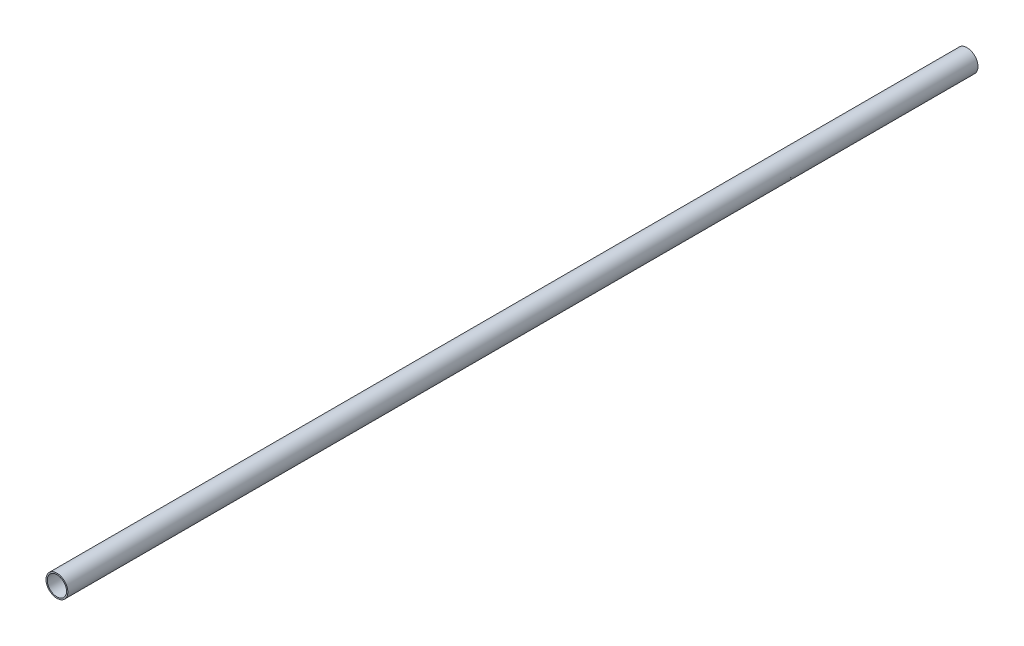
ISO-10303-21;
HEADER;
FILE_DESCRIPTION(('STEP AP214'),'2;1');
FILE_NAME('part.step','',(''),(''),'','','');
FILE_SCHEMA(('AUTOMOTIVE_DESIGN { 1 0 10303 214 1 1 1 1 }'));
ENDSEC;
DATA;
#1=APPLICATION_CONTEXT('core data for automotive mechanical design processes');
#2=APPLICATION_PROTOCOL_DEFINITION('international standard','automotive_design',2000,#1);
#3=PRODUCT_CONTEXT('',#1,'mechanical');
#4=PRODUCT('Part','Part','',(#3));
#5=PRODUCT_RELATED_PRODUCT_CATEGORY('part','',(#4));
#6=PRODUCT_DEFINITION_FORMATION('','',#4);
#7=PRODUCT_DEFINITION_CONTEXT('part definition',#1,'design');
#8=PRODUCT_DEFINITION('design','',#6,#7);
#9=PRODUCT_DEFINITION_SHAPE('','',#8);
#10=(LENGTH_UNIT() NAMED_UNIT(*) SI_UNIT(.MILLI.,.METRE.));
#11=(NAMED_UNIT(*) PLANE_ANGLE_UNIT() SI_UNIT($,.RADIAN.));
#12=(NAMED_UNIT(*) SI_UNIT($,.STERADIAN.) SOLID_ANGLE_UNIT());
#13=UNCERTAINTY_MEASURE_WITH_UNIT(LENGTH_MEASURE(1.E-05),#10,'distance_accuracy_value','');
#14=(GEOMETRIC_REPRESENTATION_CONTEXT(3) GLOBAL_UNCERTAINTY_ASSIGNED_CONTEXT((#13)) GLOBAL_UNIT_ASSIGNED_CONTEXT((#10,
#11,#12)) REPRESENTATION_CONTEXT('',''));
#15=CARTESIAN_POINT('',(0.,0.,0.));
#16=DIRECTION('',(0.,0.,1.));
#17=DIRECTION('',(1.,0.,0.));
#18=AXIS2_PLACEMENT_3D('',#15,#16,#17);
#19=CARTESIAN_POINT('',(0.,1269.,-3240.));
#20=DIRECTION('',(0.,0.,1.));
#21=DIRECTION('',(1.,0.,0.));
#22=AXIS2_PLACEMENT_3D('',#19,#20,#21);
#23=CYLINDRICAL_SURFACE('',#22,12.5);
#24=CARTESIAN_POINT('',(0.,1269.,-2140.));
#25=DIRECTION('',(0.,0.,-1.));
#26=DIRECTION('',(-1.,0.,0.));
#27=AXIS2_PLACEMENT_3D('',#24,#25,#26);
#28=CIRCLE('',#27,12.5);
#29=CARTESIAN_POINT('',(-12.5,1269.,-2140.));
#30=VERTEX_POINT('',#29);
#31=EDGE_CURVE('E50',#30,#30,#28,.T.);
#32=ORIENTED_EDGE('',*,*,#31,.F.);
#33=EDGE_LOOP('',(#32));
#34=FACE_BOUND('',#33,.T.);
#35=CARTESIAN_POINT('',(0.,1269.,-1100.));
#36=DIRECTION('',(0.,0.,1.));
#37=DIRECTION('',(1.,0.,0.));
#38=AXIS2_PLACEMENT_3D('',#35,#36,#37);
#39=CIRCLE('',#38,12.5);
#40=CARTESIAN_POINT('',(12.5,1269.,-1100.));
#41=VERTEX_POINT('',#40);
#42=EDGE_CURVE('E48',#41,#41,#39,.T.);
#43=ORIENTED_EDGE('',*,*,#42,.F.);
#44=EDGE_LOOP('',(#43));
#45=FACE_BOUND('',#44,.T.);
#46=ADVANCED_FACE('F37',(#34,#45),#23,.T.);
#47=CARTESIAN_POINT('',(-15.5,0.,-2140.));
#48=DIRECTION('',(0.,0.,-1.));
#49=DIRECTION('',(-1.,0.,0.));
#50=AXIS2_PLACEMENT_3D('',#47,#48,#49);
#51=PLANE('',#50);
#52=CARTESIAN_POINT('',(0.,1269.,-2140.));
#53=DIRECTION('',(0.,0.,-1.));
#54=DIRECTION('',(-1.,0.,0.));
#55=AXIS2_PLACEMENT_3D('',#52,#53,#54);
#56=CIRCLE('',#55,11.);
#57=CARTESIAN_POINT('',(-11.,1269.,-2140.));
#58=VERTEX_POINT('',#57);
#59=EDGE_CURVE('E41',#58,#58,#56,.T.);
#60=ORIENTED_EDGE('',*,*,#59,.F.);
#61=EDGE_LOOP('',(#60));
#62=FACE_BOUND('',#61,.T.);
#63=ORIENTED_EDGE('',*,*,#31,.T.);
#64=EDGE_LOOP('',(#63));
#65=FACE_BOUND('',#64,.T.);
#66=ADVANCED_FACE('F59',(#62,#65),#51,.T.);
#67=CARTESIAN_POINT('',(-15.5,0.,-1100.));
#68=DIRECTION('',(0.,0.,1.));
#69=DIRECTION('',(1.,0.,0.));
#70=AXIS2_PLACEMENT_3D('',#67,#68,#69);
#71=PLANE('',#70);
#72=CARTESIAN_POINT('',(0.,1269.,-1100.));
#73=DIRECTION('',(0.,0.,1.));
#74=DIRECTION('',(1.,0.,0.));
#75=AXIS2_PLACEMENT_3D('',#72,#73,#74);
#76=CIRCLE('',#75,11.);
#77=CARTESIAN_POINT('',(11.,1269.,-1100.));
#78=VERTEX_POINT('',#77);
#79=EDGE_CURVE('E10',#78,#78,#76,.T.);
#80=ORIENTED_EDGE('',*,*,#79,.F.);
#81=EDGE_LOOP('',(#80));
#82=FACE_BOUND('',#81,.T.);
#83=ORIENTED_EDGE('',*,*,#42,.T.);
#84=EDGE_LOOP('',(#83));
#85=FACE_BOUND('',#84,.T.);
#86=ADVANCED_FACE('F56',(#82,#85),#71,.T.);
#87=CARTESIAN_POINT('',(0.,1269.,-3240.));
#88=DIRECTION('',(0.,0.,1.));
#89=DIRECTION('',(1.,0.,0.));
#90=AXIS2_PLACEMENT_3D('',#87,#88,#89);
#91=CYLINDRICAL_SURFACE('',#90,11.);
#92=ORIENTED_EDGE('',*,*,#59,.T.);
#93=EDGE_LOOP('',(#92));
#94=FACE_BOUND('',#93,.T.);
#95=ORIENTED_EDGE('',*,*,#79,.T.);
#96=EDGE_LOOP('',(#95));
#97=FACE_BOUND('',#96,.T.);
#98=ADVANCED_FACE('F39',(#94,#97),#91,.F.);
#99=CLOSED_SHELL('',(#46,#66,#86,#98));
#100=MANIFOLD_SOLID_BREP('B2',#99);
#101=ADVANCED_BREP_SHAPE_REPRESENTATION('',(#18,#100),#14);
#102=SHAPE_DEFINITION_REPRESENTATION(#9,#101);
ENDSEC;
END-ISO-10303-21;
